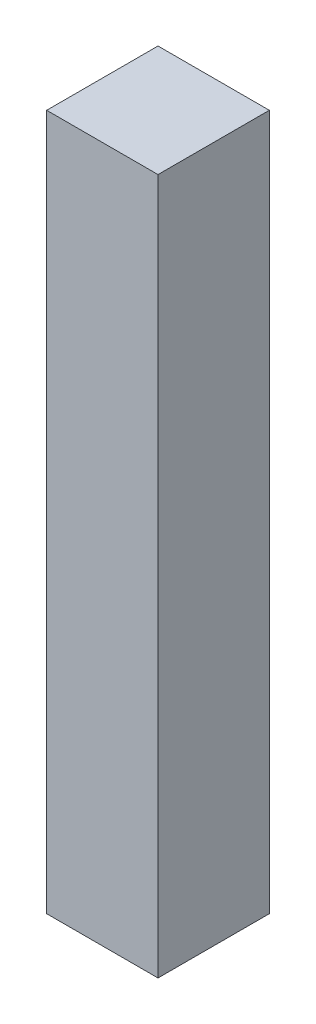
ISO-10303-21;
HEADER;
FILE_DESCRIPTION(('STEP AP214'),'2;1');
FILE_NAME('part.step','',(''),(''),'','','');
FILE_SCHEMA(('AUTOMOTIVE_DESIGN { 1 0 10303 214 1 1 1 1 }'));
ENDSEC;
DATA;
#1=APPLICATION_CONTEXT('core data for automotive mechanical design processes');
#2=APPLICATION_PROTOCOL_DEFINITION('international standard','automotive_design',2000,#1);
#3=PRODUCT_CONTEXT('',#1,'mechanical');
#4=PRODUCT('Part','Part','',(#3));
#5=PRODUCT_RELATED_PRODUCT_CATEGORY('part','',(#4));
#6=PRODUCT_DEFINITION_FORMATION('','',#4);
#7=PRODUCT_DEFINITION_CONTEXT('part definition',#1,'design');
#8=PRODUCT_DEFINITION('design','',#6,#7);
#9=PRODUCT_DEFINITION_SHAPE('','',#8);
#10=(LENGTH_UNIT() NAMED_UNIT(*) SI_UNIT(.MILLI.,.METRE.));
#11=(NAMED_UNIT(*) PLANE_ANGLE_UNIT() SI_UNIT($,.RADIAN.));
#12=(NAMED_UNIT(*) SI_UNIT($,.STERADIAN.) SOLID_ANGLE_UNIT());
#13=UNCERTAINTY_MEASURE_WITH_UNIT(LENGTH_MEASURE(1.E-05),#10,'distance_accuracy_value','');
#14=(GEOMETRIC_REPRESENTATION_CONTEXT(3) GLOBAL_UNCERTAINTY_ASSIGNED_CONTEXT((#13)) GLOBAL_UNIT_ASSIGNED_CONTEXT((#10,
#11,#12)) REPRESENTATION_CONTEXT('',''));
#15=CARTESIAN_POINT('',(0.,0.,0.));
#16=DIRECTION('',(0.,0.,1.));
#17=DIRECTION('',(1.,0.,0.));
#18=AXIS2_PLACEMENT_3D('',#15,#16,#17);
#19=CARTESIAN_POINT('',(20.,-125.,40.));
#20=DIRECTION('',(-1.,0.,0.));
#21=DIRECTION('',(0.,0.,1.));
#22=AXIS2_PLACEMENT_3D('',#19,#20,#21);
#23=PLANE('',#22);
#24=DIRECTION('',(0.,1.,0.));
#25=VECTOR('',#24,1.);
#26=CARTESIAN_POINT('',(20.,-125.,0.));
#27=LINE('',#26,#25);
#28=CARTESIAN_POINT('',(20.,-125.,0.));
#29=VERTEX_POINT('',#28);
#30=CARTESIAN_POINT('',(20.,125.,0.));
#31=VERTEX_POINT('',#30);
#32=EDGE_CURVE('E96',#29,#31,#27,.T.);
#33=ORIENTED_EDGE('',*,*,#32,.T.);
#34=DIRECTION('',(0.,0.,-1.));
#35=VECTOR('',#34,1.);
#36=CARTESIAN_POINT('',(20.,125.,40.));
#37=LINE('',#36,#35);
#38=CARTESIAN_POINT('',(20.,125.,40.));
#39=VERTEX_POINT('',#38);
#40=EDGE_CURVE('E11',#39,#31,#37,.T.);
#41=ORIENTED_EDGE('',*,*,#40,.F.);
#42=DIRECTION('',(0.,1.,0.));
#43=VECTOR('',#42,1.);
#44=CARTESIAN_POINT('',(20.,-125.,40.));
#45=LINE('',#44,#43);
#46=CARTESIAN_POINT('',(20.,-125.,40.));
#47=VERTEX_POINT('',#46);
#48=EDGE_CURVE('E84',#47,#39,#45,.T.);
#49=ORIENTED_EDGE('',*,*,#48,.F.);
#50=DIRECTION('',(0.,0.,-1.));
#51=VECTOR('',#50,1.);
#52=CARTESIAN_POINT('',(20.,-125.,40.));
#53=LINE('',#52,#51);
#54=EDGE_CURVE('E92',#47,#29,#53,.T.);
#55=ORIENTED_EDGE('',*,*,#54,.T.);
#56=EDGE_LOOP('',(#33,#41,#49,#55));
#57=FACE_BOUND('',#56,.T.);
#58=ADVANCED_FACE('F33',(#57),#23,.F.);
#59=CARTESIAN_POINT('',(-20.,125.,40.));
#60=DIRECTION('',(0.,-1.,0.));
#61=DIRECTION('',(0.,0.,-1.));
#62=AXIS2_PLACEMENT_3D('',#59,#60,#61);
#63=PLANE('',#62);
#64=DIRECTION('',(-1.,0.,0.));
#65=VECTOR('',#64,1.);
#66=CARTESIAN_POINT('',(-20.,125.,0.));
#67=LINE('',#66,#65);
#68=CARTESIAN_POINT('',(-20.,125.,0.));
#69=VERTEX_POINT('',#68);
#70=EDGE_CURVE('E88',#31,#69,#67,.T.);
#71=ORIENTED_EDGE('',*,*,#70,.T.);
#72=DIRECTION('',(0.,0.,-1.));
#73=VECTOR('',#72,1.);
#74=CARTESIAN_POINT('',(-20.,125.,40.));
#75=LINE('',#74,#73);
#76=CARTESIAN_POINT('',(-20.,125.,40.));
#77=VERTEX_POINT('',#76);
#78=EDGE_CURVE('E41',#77,#69,#75,.T.);
#79=ORIENTED_EDGE('',*,*,#78,.F.);
#80=DIRECTION('',(-1.,0.,0.));
#81=VECTOR('',#80,1.);
#82=CARTESIAN_POINT('',(-20.,125.,40.));
#83=LINE('',#82,#81);
#84=EDGE_CURVE('E79',#39,#77,#83,.T.);
#85=ORIENTED_EDGE('',*,*,#84,.F.);
#86=ORIENTED_EDGE('',*,*,#40,.T.);
#87=EDGE_LOOP('',(#71,#79,#85,#86));
#88=FACE_BOUND('',#87,.T.);
#89=ADVANCED_FACE('F87',(#88),#63,.F.);
#90=CARTESIAN_POINT('',(-20.,-125.,40.));
#91=DIRECTION('',(1.,0.,0.));
#92=DIRECTION('',(0.,0.,-1.));
#93=AXIS2_PLACEMENT_3D('',#90,#91,#92);
#94=PLANE('',#93);
#95=DIRECTION('',(0.,-1.,0.));
#96=VECTOR('',#95,1.);
#97=CARTESIAN_POINT('',(-20.,-125.,0.));
#98=LINE('',#97,#96);
#99=CARTESIAN_POINT('',(-20.,-125.,0.));
#100=VERTEX_POINT('',#99);
#101=EDGE_CURVE('E66',#69,#100,#98,.T.);
#102=ORIENTED_EDGE('',*,*,#101,.T.);
#103=DIRECTION('',(0.,0.,-1.));
#104=VECTOR('',#103,1.);
#105=CARTESIAN_POINT('',(-20.,-125.,40.));
#106=LINE('',#105,#104);
#107=CARTESIAN_POINT('',(-20.,-125.,40.));
#108=VERTEX_POINT('',#107);
#109=EDGE_CURVE('E89',#108,#100,#106,.T.);
#110=ORIENTED_EDGE('',*,*,#109,.F.);
#111=DIRECTION('',(0.,-1.,0.));
#112=VECTOR('',#111,1.);
#113=CARTESIAN_POINT('',(-20.,-125.,40.));
#114=LINE('',#113,#112);
#115=EDGE_CURVE('E82',#77,#108,#114,.T.);
#116=ORIENTED_EDGE('',*,*,#115,.F.);
#117=ORIENTED_EDGE('',*,*,#78,.T.);
#118=EDGE_LOOP('',(#102,#110,#116,#117));
#119=FACE_BOUND('',#118,.T.);
#120=ADVANCED_FACE('F90',(#119),#94,.F.);
#121=CARTESIAN_POINT('',(-20.,-125.,40.));
#122=DIRECTION('',(0.,1.,0.));
#123=DIRECTION('',(0.,0.,1.));
#124=AXIS2_PLACEMENT_3D('',#121,#122,#123);
#125=PLANE('',#124);
#126=DIRECTION('',(1.,0.,0.));
#127=VECTOR('',#126,1.);
#128=CARTESIAN_POINT('',(-20.,-125.,0.));
#129=LINE('',#128,#127);
#130=EDGE_CURVE('E72',#100,#29,#129,.T.);
#131=ORIENTED_EDGE('',*,*,#130,.T.);
#132=ORIENTED_EDGE('',*,*,#54,.F.);
#133=DIRECTION('',(1.,0.,0.));
#134=VECTOR('',#133,1.);
#135=CARTESIAN_POINT('',(-20.,-125.,40.));
#136=LINE('',#135,#134);
#137=EDGE_CURVE('E49',#108,#47,#136,.T.);
#138=ORIENTED_EDGE('',*,*,#137,.F.);
#139=ORIENTED_EDGE('',*,*,#109,.T.);
#140=EDGE_LOOP('',(#131,#132,#138,#139));
#141=FACE_BOUND('',#140,.T.);
#142=ADVANCED_FACE('F103',(#141),#125,.F.);
#143=CARTESIAN_POINT('',(0.,0.,40.));
#144=DIRECTION('',(0.,0.,-1.));
#145=DIRECTION('',(-1.,0.,0.));
#146=AXIS2_PLACEMENT_3D('',#143,#144,#145);
#147=PLANE('',#146);
#148=ORIENTED_EDGE('',*,*,#48,.T.);
#149=ORIENTED_EDGE('',*,*,#84,.T.);
#150=ORIENTED_EDGE('',*,*,#115,.T.);
#151=ORIENTED_EDGE('',*,*,#137,.T.);
#152=EDGE_LOOP('',(#148,#149,#150,#151));
#153=FACE_BOUND('',#152,.T.);
#154=ADVANCED_FACE('F80',(#153),#147,.F.);
#155=CARTESIAN_POINT('',(0.,0.,0.));
#156=DIRECTION('',(0.,0.,-1.));
#157=DIRECTION('',(-1.,0.,0.));
#158=AXIS2_PLACEMENT_3D('',#155,#156,#157);
#159=PLANE('',#158);
#160=ORIENTED_EDGE('',*,*,#32,.F.);
#161=ORIENTED_EDGE('',*,*,#130,.F.);
#162=ORIENTED_EDGE('',*,*,#101,.F.);
#163=ORIENTED_EDGE('',*,*,#70,.F.);
#164=EDGE_LOOP('',(#160,#161,#162,#163));
#165=FACE_BOUND('',#164,.T.);
#166=ADVANCED_FACE('F106',(#165),#159,.T.);
#167=CLOSED_SHELL('',(#58,#89,#120,#142,#154,#166));
#168=MANIFOLD_SOLID_BREP('B2',#167);
#169=ADVANCED_BREP_SHAPE_REPRESENTATION('',(#18,#168),#14);
#170=SHAPE_DEFINITION_REPRESENTATION(#9,#169);
ENDSEC;
END-ISO-10303-21;
